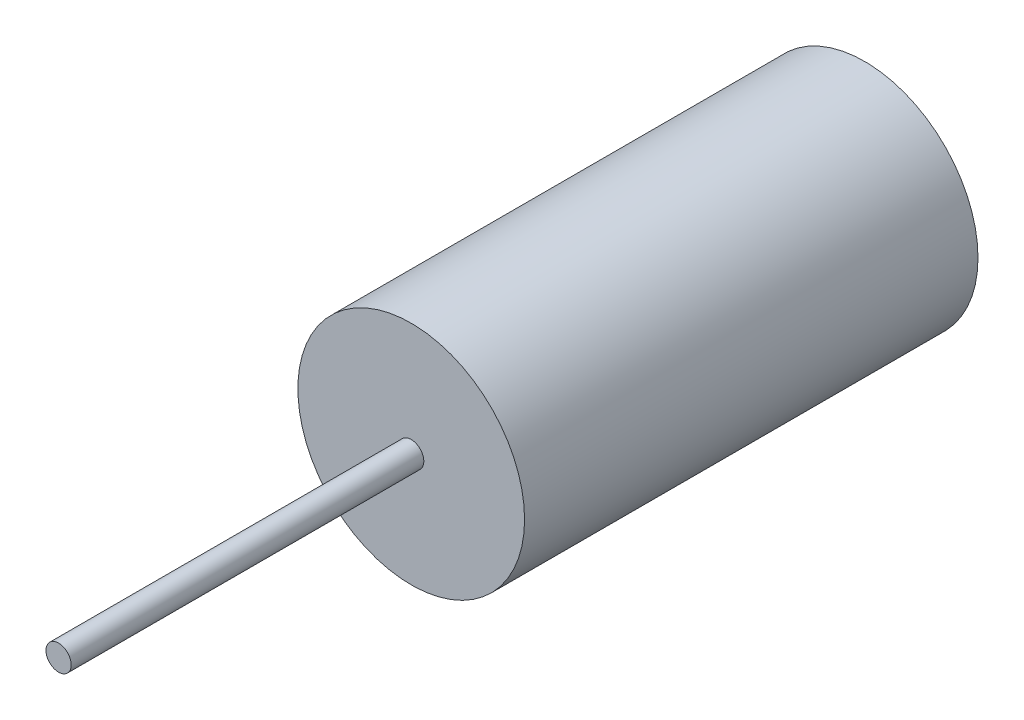
ISO-10303-21;
HEADER;
FILE_DESCRIPTION(('STEP AP214'),'2;1');
FILE_NAME('part.step','',(''),(''),'','','');
FILE_SCHEMA(('AUTOMOTIVE_DESIGN { 1 0 10303 214 1 1 1 1 }'));
ENDSEC;
DATA;
#1=APPLICATION_CONTEXT('core data for automotive mechanical design processes');
#2=APPLICATION_PROTOCOL_DEFINITION('international standard','automotive_design',2000,#1);
#3=PRODUCT_CONTEXT('',#1,'mechanical');
#4=PRODUCT('Part','Part','',(#3));
#5=PRODUCT_RELATED_PRODUCT_CATEGORY('part','',(#4));
#6=PRODUCT_DEFINITION_FORMATION('','',#4);
#7=PRODUCT_DEFINITION_CONTEXT('part definition',#1,'design');
#8=PRODUCT_DEFINITION('design','',#6,#7);
#9=PRODUCT_DEFINITION_SHAPE('','',#8);
#10=(LENGTH_UNIT() NAMED_UNIT(*) SI_UNIT(.MILLI.,.METRE.));
#11=(NAMED_UNIT(*) PLANE_ANGLE_UNIT() SI_UNIT($,.RADIAN.));
#12=(NAMED_UNIT(*) SI_UNIT($,.STERADIAN.) SOLID_ANGLE_UNIT());
#13=UNCERTAINTY_MEASURE_WITH_UNIT(LENGTH_MEASURE(1.E-05),#10,'distance_accuracy_value','');
#14=(GEOMETRIC_REPRESENTATION_CONTEXT(3) GLOBAL_UNCERTAINTY_ASSIGNED_CONTEXT((#13)) GLOBAL_UNIT_ASSIGNED_CONTEXT((#10,
#11,#12)) REPRESENTATION_CONTEXT('',''));
#15=CARTESIAN_POINT('',(0.,0.,0.));
#16=DIRECTION('',(0.,0.,1.));
#17=DIRECTION('',(1.,0.,0.));
#18=AXIS2_PLACEMENT_3D('',#15,#16,#17);
#19=CARTESIAN_POINT('',(0.,0.,228.6));
#20=DIRECTION('',(0.,0.,-1.));
#21=DIRECTION('',(-1.,0.,0.));
#22=AXIS2_PLACEMENT_3D('',#19,#20,#21);
#23=CYLINDRICAL_SURFACE('',#22,57.15);
#24=CARTESIAN_POINT('',(0.,0.,228.6));
#25=DIRECTION('',(0.,0.,1.));
#26=DIRECTION('',(1.,0.,0.));
#27=AXIS2_PLACEMENT_3D('',#24,#25,#26);
#28=CIRCLE('',#27,57.15);
#29=CARTESIAN_POINT('',(57.15,0.,228.6));
#30=VERTEX_POINT('',#29);
#31=EDGE_CURVE('E10',#30,#30,#28,.T.);
#32=ORIENTED_EDGE('',*,*,#31,.F.);
#33=EDGE_LOOP('',(#32));
#34=FACE_BOUND('',#33,.T.);
#35=CARTESIAN_POINT('',(0.,0.,0.));
#36=DIRECTION('',(0.,0.,1.));
#37=DIRECTION('',(1.,0.,0.));
#38=AXIS2_PLACEMENT_3D('',#35,#36,#37);
#39=CIRCLE('',#38,57.15);
#40=CARTESIAN_POINT('',(57.15,0.,0.));
#41=VERTEX_POINT('',#40);
#42=EDGE_CURVE('E40',#41,#41,#39,.T.);
#43=ORIENTED_EDGE('',*,*,#42,.T.);
#44=EDGE_LOOP('',(#43));
#45=FACE_BOUND('',#44,.T.);
#46=ADVANCED_FACE('F37',(#34,#45),#23,.T.);
#47=CARTESIAN_POINT('',(0.,0.,228.6));
#48=DIRECTION('',(0.,0.,1.));
#49=DIRECTION('',(1.,0.,0.));
#50=AXIS2_PLACEMENT_3D('',#47,#48,#49);
#51=PLANE('',#50);
#52=CARTESIAN_POINT('',(0.,0.,228.6));
#53=DIRECTION('',(0.,0.,1.));
#54=DIRECTION('',(1.,0.,0.));
#55=AXIS2_PLACEMENT_3D('',#52,#53,#54);
#56=CIRCLE('',#55,6.35);
#57=CARTESIAN_POINT('',(6.35,0.,228.6));
#58=VERTEX_POINT('',#57);
#59=EDGE_CURVE('E51',#58,#58,#56,.T.);
#60=ORIENTED_EDGE('',*,*,#59,.F.);
#61=EDGE_LOOP('',(#60));
#62=FACE_BOUND('',#61,.T.);
#63=ORIENTED_EDGE('',*,*,#31,.T.);
#64=EDGE_LOOP('',(#63));
#65=FACE_BOUND('',#64,.T.);
#66=ADVANCED_FACE('F68',(#62,#65),#51,.T.);
#67=CARTESIAN_POINT('',(0.,0.,0.));
#68=DIRECTION('',(0.,0.,1.));
#69=DIRECTION('',(1.,0.,0.));
#70=AXIS2_PLACEMENT_3D('',#67,#68,#69);
#71=PLANE('',#70);
#72=ORIENTED_EDGE('',*,*,#42,.F.);
#73=EDGE_LOOP('',(#72));
#74=FACE_BOUND('',#73,.T.);
#75=ADVANCED_FACE('F64',(#74),#71,.F.);
#76=CARTESIAN_POINT('',(0.,0.,406.4));
#77=DIRECTION('',(0.,0.,-1.));
#78=DIRECTION('',(-1.,0.,0.));
#79=AXIS2_PLACEMENT_3D('',#76,#77,#78);
#80=CYLINDRICAL_SURFACE('',#79,6.35);
#81=CARTESIAN_POINT('',(0.,0.,406.4));
#82=DIRECTION('',(0.,0.,1.));
#83=DIRECTION('',(1.,0.,0.));
#84=AXIS2_PLACEMENT_3D('',#81,#82,#83);
#85=CIRCLE('',#84,6.35);
#86=CARTESIAN_POINT('',(6.35,0.,406.4));
#87=VERTEX_POINT('',#86);
#88=EDGE_CURVE('E49',#87,#87,#85,.T.);
#89=ORIENTED_EDGE('',*,*,#88,.F.);
#90=EDGE_LOOP('',(#89));
#91=FACE_BOUND('',#90,.T.);
#92=ORIENTED_EDGE('',*,*,#59,.T.);
#93=EDGE_LOOP('',(#92));
#94=FACE_BOUND('',#93,.T.);
#95=ADVANCED_FACE('F61',(#91,#94),#80,.T.);
#96=CARTESIAN_POINT('',(0.,0.,406.4));
#97=DIRECTION('',(0.,0.,1.));
#98=DIRECTION('',(1.,0.,0.));
#99=AXIS2_PLACEMENT_3D('',#96,#97,#98);
#100=PLANE('',#99);
#101=ORIENTED_EDGE('',*,*,#88,.T.);
#102=EDGE_LOOP('',(#101));
#103=FACE_BOUND('',#102,.T.);
#104=ADVANCED_FACE('F59',(#103),#100,.T.);
#105=CLOSED_SHELL('',(#46,#66,#75,#95,#104));
#106=MANIFOLD_SOLID_BREP('B2',#105);
#107=ADVANCED_BREP_SHAPE_REPRESENTATION('',(#18,#106),#14);
#108=SHAPE_DEFINITION_REPRESENTATION(#9,#107);
ENDSEC;
END-ISO-10303-21;
